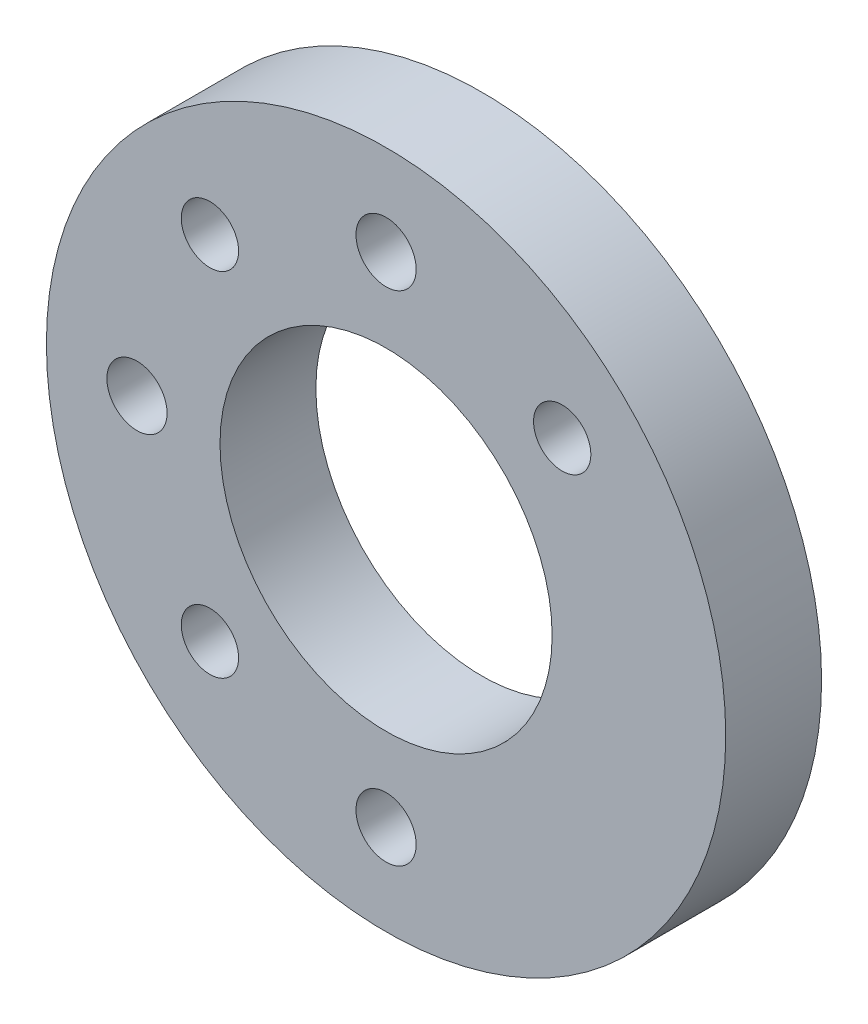
ISO-10303-21;
HEADER;
FILE_DESCRIPTION(('STEP AP214'),'2;1');
FILE_NAME('part.step','',(''),(''),'','','');
FILE_SCHEMA(('AUTOMOTIVE_DESIGN { 1 0 10303 214 1 1 1 1 }'));
ENDSEC;
DATA;
#1=APPLICATION_CONTEXT('core data for automotive mechanical design processes');
#2=APPLICATION_PROTOCOL_DEFINITION('international standard','automotive_design',2000,#1);
#3=PRODUCT_CONTEXT('',#1,'mechanical');
#4=PRODUCT('Part','Part','',(#3));
#5=PRODUCT_RELATED_PRODUCT_CATEGORY('part','',(#4));
#6=PRODUCT_DEFINITION_FORMATION('','',#4);
#7=PRODUCT_DEFINITION_CONTEXT('part definition',#1,'design');
#8=PRODUCT_DEFINITION('design','',#6,#7);
#9=PRODUCT_DEFINITION_SHAPE('','',#8);
#10=(LENGTH_UNIT() NAMED_UNIT(*) SI_UNIT(.MILLI.,.METRE.));
#11=(NAMED_UNIT(*) PLANE_ANGLE_UNIT() SI_UNIT($,.RADIAN.));
#12=(NAMED_UNIT(*) SI_UNIT($,.STERADIAN.) SOLID_ANGLE_UNIT());
#13=UNCERTAINTY_MEASURE_WITH_UNIT(LENGTH_MEASURE(1.E-05),#10,'distance_accuracy_value','');
#14=(GEOMETRIC_REPRESENTATION_CONTEXT(3) GLOBAL_UNCERTAINTY_ASSIGNED_CONTEXT((#13)) GLOBAL_UNIT_ASSIGNED_CONTEXT((#10,
#11,#12)) REPRESENTATION_CONTEXT('',''));
#15=CARTESIAN_POINT('',(0.,0.,0.));
#16=DIRECTION('',(0.,0.,1.));
#17=DIRECTION('',(1.,0.,0.));
#18=AXIS2_PLACEMENT_3D('',#15,#16,#17);
#19=CARTESIAN_POINT('',(0.,0.,6.35));
#20=DIRECTION('',(0.,0.,1.));
#21=DIRECTION('',(1.,0.,0.));
#22=AXIS2_PLACEMENT_3D('',#19,#20,#21);
#23=PLANE('',#22);
#24=CARTESIAN_POINT('',(-16.5,0.,6.35));
#25=DIRECTION('',(0.,0.,1.));
#26=DIRECTION('',(1.,0.,0.));
#27=AXIS2_PLACEMENT_3D('',#24,#25,#26);
#28=CIRCLE('',#27,1.9939);
#29=CARTESIAN_POINT('',(-14.5061,0.,6.35));
#30=VERTEX_POINT('',#29);
#31=EDGE_CURVE('E87',#30,#30,#28,.T.);
#32=ORIENTED_EDGE('',*,*,#31,.F.);
#33=EDGE_LOOP('',(#32));
#34=FACE_BOUND('',#33,.T.);
#35=CARTESIAN_POINT('',(0.,-16.5,6.35));
#36=DIRECTION('',(0.,0.,1.));
#37=DIRECTION('',(1.,0.,0.));
#38=AXIS2_PLACEMENT_3D('',#35,#36,#37);
#39=CIRCLE('',#38,1.9939);
#40=CARTESIAN_POINT('',(1.9939,-16.5,6.35));
#41=VERTEX_POINT('',#40);
#42=EDGE_CURVE('E78',#41,#41,#39,.T.);
#43=ORIENTED_EDGE('',*,*,#42,.F.);
#44=EDGE_LOOP('',(#43));
#45=FACE_BOUND('',#44,.T.);
#46=CARTESIAN_POINT('',(0.,16.5,6.35));
#47=DIRECTION('',(0.,0.,1.));
#48=DIRECTION('',(1.,0.,0.));
#49=AXIS2_PLACEMENT_3D('',#46,#47,#48);
#50=CIRCLE('',#49,1.9939);
#51=CARTESIAN_POINT('',(1.9939,16.5,6.35));
#52=VERTEX_POINT('',#51);
#53=EDGE_CURVE('E67',#52,#52,#50,.T.);
#54=ORIENTED_EDGE('',*,*,#53,.F.);
#55=EDGE_LOOP('',(#54));
#56=FACE_BOUND('',#55,.T.);
#57=CARTESIAN_POINT('',(0.,0.,6.35));
#58=DIRECTION('',(0.,0.,1.));
#59=DIRECTION('',(1.,0.,0.));
#60=AXIS2_PLACEMENT_3D('',#57,#58,#59);
#61=CIRCLE('',#60,22.5);
#62=CARTESIAN_POINT('',(22.5,0.,6.35));
#63=VERTEX_POINT('',#62);
#64=EDGE_CURVE('E57',#63,#63,#61,.T.);
#65=ORIENTED_EDGE('',*,*,#64,.T.);
#66=EDGE_LOOP('',(#65));
#67=FACE_BOUND('',#66,.T.);
#68=CARTESIAN_POINT('',(0.,0.,6.35));
#69=DIRECTION('',(0.,0.,1.));
#70=DIRECTION('',(1.,0.,0.));
#71=AXIS2_PLACEMENT_3D('',#68,#69,#70);
#72=CIRCLE('',#71,11.);
#73=CARTESIAN_POINT('',(11.,0.,6.35));
#74=VERTEX_POINT('',#73);
#75=EDGE_CURVE('E61',#74,#74,#72,.T.);
#76=ORIENTED_EDGE('',*,*,#75,.F.);
#77=EDGE_LOOP('',(#76));
#78=FACE_BOUND('',#77,.T.);
#79=CARTESIAN_POINT('',(11.6672618895781,11.667261889578,6.35));
#80=DIRECTION('',(0.,0.,1.));
#81=DIRECTION('',(1.,0.,0.));
#82=AXIS2_PLACEMENT_3D('',#79,#80,#81);
#83=CIRCLE('',#82,1.89865);
#84=CARTESIAN_POINT('',(13.5659118895781,11.667261889578,6.35));
#85=VERTEX_POINT('',#84);
#86=EDGE_CURVE('E73',#85,#85,#83,.T.);
#87=ORIENTED_EDGE('',*,*,#86,.F.);
#88=EDGE_LOOP('',(#87));
#89=FACE_BOUND('',#88,.T.);
#90=CARTESIAN_POINT('',(-11.667261889578,-11.667261889578,6.35));
#91=DIRECTION('',(0.,0.,1.));
#92=DIRECTION('',(1.,0.,0.));
#93=AXIS2_PLACEMENT_3D('',#90,#91,#92);
#94=CIRCLE('',#93,1.89865);
#95=CARTESIAN_POINT('',(-9.76861188957805,-11.667261889578,6.35));
#96=VERTEX_POINT('',#95);
#97=EDGE_CURVE('E82',#96,#96,#94,.T.);
#98=ORIENTED_EDGE('',*,*,#97,.F.);
#99=EDGE_LOOP('',(#98));
#100=FACE_BOUND('',#99,.T.);
#101=CARTESIAN_POINT('',(-11.667261889578,11.6672618895781,6.35));
#102=DIRECTION('',(0.,0.,1.));
#103=DIRECTION('',(1.,0.,0.));
#104=AXIS2_PLACEMENT_3D('',#101,#102,#103);
#105=CIRCLE('',#104,1.89865);
#106=CARTESIAN_POINT('',(-9.76861188957802,11.6672618895781,6.35));
#107=VERTEX_POINT('',#106);
#108=EDGE_CURVE('E91',#107,#107,#105,.T.);
#109=ORIENTED_EDGE('',*,*,#108,.F.);
#110=EDGE_LOOP('',(#109));
#111=FACE_BOUND('',#110,.T.);
#112=ADVANCED_FACE('F31',(#34,#45,#56,#67,#78,#89,#100,#111),#23,.T.);
#113=CARTESIAN_POINT('',(0.,0.,0.));
#114=DIRECTION('',(0.,0.,1.));
#115=DIRECTION('',(1.,0.,0.));
#116=AXIS2_PLACEMENT_3D('',#113,#114,#115);
#117=PLANE('',#116);
#118=CARTESIAN_POINT('',(-11.667261889578,-11.667261889578,0.));
#119=DIRECTION('',(0.,0.,1.));
#120=DIRECTION('',(1.,0.,0.));
#121=AXIS2_PLACEMENT_3D('',#118,#119,#120);
#122=CIRCLE('',#121,3.89890000002971);
#123=CARTESIAN_POINT('',(-7.76836188954834,-11.667261889578,0.));
#124=VERTEX_POINT('',#123);
#125=EDGE_CURVE('E46',#124,#124,#122,.T.);
#126=ORIENTED_EDGE('',*,*,#125,.T.);
#127=EDGE_LOOP('',(#126));
#128=FACE_BOUND('',#127,.T.);
#129=CARTESIAN_POINT('',(-11.667261889578,11.6672618895781,0.));
#130=DIRECTION('',(0.,0.,1.));
#131=DIRECTION('',(1.,0.,0.));
#132=AXIS2_PLACEMENT_3D('',#129,#130,#131);
#133=CIRCLE('',#132,3.89890000002971);
#134=CARTESIAN_POINT('',(-7.76836188954831,11.6672618895781,0.));
#135=VERTEX_POINT('',#134);
#136=EDGE_CURVE('E51',#135,#135,#133,.T.);
#137=ORIENTED_EDGE('',*,*,#136,.T.);
#138=EDGE_LOOP('',(#137));
#139=FACE_BOUND('',#138,.T.);
#140=CARTESIAN_POINT('',(11.6672618895781,11.667261889578,0.));
#141=DIRECTION('',(0.,0.,1.));
#142=DIRECTION('',(1.,0.,0.));
#143=AXIS2_PLACEMENT_3D('',#140,#141,#142);
#144=CIRCLE('',#143,3.89890000002971);
#145=CARTESIAN_POINT('',(15.5661618896078,11.667261889578,0.));
#146=VERTEX_POINT('',#145);
#147=EDGE_CURVE('E54',#146,#146,#144,.T.);
#148=ORIENTED_EDGE('',*,*,#147,.T.);
#149=EDGE_LOOP('',(#148));
#150=FACE_BOUND('',#149,.T.);
#151=CARTESIAN_POINT('',(0.,0.,0.));
#152=DIRECTION('',(0.,0.,1.));
#153=DIRECTION('',(1.,0.,0.));
#154=AXIS2_PLACEMENT_3D('',#151,#152,#153);
#155=CIRCLE('',#154,22.5);
#156=CARTESIAN_POINT('',(22.5,0.,0.));
#157=VERTEX_POINT('',#156);
#158=EDGE_CURVE('E58',#157,#157,#155,.T.);
#159=ORIENTED_EDGE('',*,*,#158,.F.);
#160=EDGE_LOOP('',(#159));
#161=FACE_BOUND('',#160,.T.);
#162=CARTESIAN_POINT('',(0.,0.,0.));
#163=DIRECTION('',(0.,0.,1.));
#164=DIRECTION('',(1.,0.,0.));
#165=AXIS2_PLACEMENT_3D('',#162,#163,#164);
#166=CIRCLE('',#165,11.);
#167=CARTESIAN_POINT('',(11.,0.,0.));
#168=VERTEX_POINT('',#167);
#169=EDGE_CURVE('E64',#168,#168,#166,.T.);
#170=ORIENTED_EDGE('',*,*,#169,.T.);
#171=EDGE_LOOP('',(#170));
#172=FACE_BOUND('',#171,.T.);
#173=CARTESIAN_POINT('',(0.,16.5,0.));
#174=DIRECTION('',(0.,0.,1.));
#175=DIRECTION('',(1.,0.,0.));
#176=AXIS2_PLACEMENT_3D('',#173,#174,#175);
#177=CIRCLE('',#176,1.9939);
#178=CARTESIAN_POINT('',(1.9939,16.5,0.));
#179=VERTEX_POINT('',#178);
#180=EDGE_CURVE('E70',#179,#179,#177,.T.);
#181=ORIENTED_EDGE('',*,*,#180,.T.);
#182=EDGE_LOOP('',(#181));
#183=FACE_BOUND('',#182,.T.);
#184=CARTESIAN_POINT('',(0.,-16.5,0.));
#185=DIRECTION('',(0.,0.,1.));
#186=DIRECTION('',(1.,0.,0.));
#187=AXIS2_PLACEMENT_3D('',#184,#185,#186);
#188=CIRCLE('',#187,1.9939);
#189=CARTESIAN_POINT('',(1.9939,-16.5,0.));
#190=VERTEX_POINT('',#189);
#191=EDGE_CURVE('E79',#190,#190,#188,.T.);
#192=ORIENTED_EDGE('',*,*,#191,.T.);
#193=EDGE_LOOP('',(#192));
#194=FACE_BOUND('',#193,.T.);
#195=CARTESIAN_POINT('',(-16.5,0.,0.));
#196=DIRECTION('',(0.,0.,1.));
#197=DIRECTION('',(1.,0.,0.));
#198=AXIS2_PLACEMENT_3D('',#195,#196,#197);
#199=CIRCLE('',#198,1.9939);
#200=CARTESIAN_POINT('',(-14.5061,0.,0.));
#201=VERTEX_POINT('',#200);
#202=EDGE_CURVE('E88',#201,#201,#199,.T.);
#203=ORIENTED_EDGE('',*,*,#202,.T.);
#204=EDGE_LOOP('',(#203));
#205=FACE_BOUND('',#204,.T.);
#206=ADVANCED_FACE('F100',(#128,#139,#150,#161,#172,#183,#194,#205),#117,.F.);
#207=CARTESIAN_POINT('',(0.,0.,6.35));
#208=DIRECTION('',(0.,0.,-1.));
#209=DIRECTION('',(-1.,0.,0.));
#210=AXIS2_PLACEMENT_3D('',#207,#208,#209);
#211=CYLINDRICAL_SURFACE('',#210,22.5);
#212=ORIENTED_EDGE('',*,*,#64,.F.);
#213=EDGE_LOOP('',(#212));
#214=FACE_BOUND('',#213,.T.);
#215=ORIENTED_EDGE('',*,*,#158,.T.);
#216=EDGE_LOOP('',(#215));
#217=FACE_BOUND('',#216,.T.);
#218=ADVANCED_FACE('F106',(#214,#217),#211,.T.);
#219=CARTESIAN_POINT('',(0.,0.,6.35));
#220=DIRECTION('',(0.,0.,-1.));
#221=DIRECTION('',(-1.,0.,0.));
#222=AXIS2_PLACEMENT_3D('',#219,#220,#221);
#223=CYLINDRICAL_SURFACE('',#222,11.);
#224=ORIENTED_EDGE('',*,*,#75,.T.);
#225=EDGE_LOOP('',(#224));
#226=FACE_BOUND('',#225,.T.);
#227=ORIENTED_EDGE('',*,*,#169,.F.);
#228=EDGE_LOOP('',(#227));
#229=FACE_BOUND('',#228,.T.);
#230=ADVANCED_FACE('F112',(#226,#229),#223,.F.);
#231=CARTESIAN_POINT('',(0.,16.5,6.35));
#232=DIRECTION('',(0.,0.,-1.));
#233=DIRECTION('',(-1.,0.,0.));
#234=AXIS2_PLACEMENT_3D('',#231,#232,#233);
#235=CYLINDRICAL_SURFACE('',#234,1.9939);
#236=ORIENTED_EDGE('',*,*,#53,.T.);
#237=EDGE_LOOP('',(#236));
#238=FACE_BOUND('',#237,.T.);
#239=ORIENTED_EDGE('',*,*,#180,.F.);
#240=EDGE_LOOP('',(#239));
#241=FACE_BOUND('',#240,.T.);
#242=ADVANCED_FACE('F163',(#238,#241),#235,.F.);
#243=CARTESIAN_POINT('',(11.6672618895781,11.667261889578,6.35));
#244=DIRECTION('',(0.,0.,-1.));
#245=DIRECTION('',(-1.,0.,0.));
#246=AXIS2_PLACEMENT_3D('',#243,#244,#245);
#247=CYLINDRICAL_SURFACE('',#246,1.89865);
#248=CARTESIAN_POINT('',(11.6672618895781,11.667261889578,2.30102440657801));
#249=DIRECTION('',(0.,0.,1.));
#250=DIRECTION('',(1.,0.,0.));
#251=AXIS2_PLACEMENT_3D('',#248,#249,#250);
#252=CIRCLE('',#251,1.89865);
#253=CARTESIAN_POINT('',(13.5659118895781,11.667261889578,2.30102440657801));
#254=VERTEX_POINT('',#253);
#255=EDGE_CURVE('E10',#254,#254,#252,.F.);
#256=ORIENTED_EDGE('',*,*,#255,.T.);
#257=EDGE_LOOP('',(#256));
#258=FACE_BOUND('',#257,.T.);
#259=ORIENTED_EDGE('',*,*,#86,.T.);
#260=EDGE_LOOP('',(#259));
#261=FACE_BOUND('',#260,.T.);
#262=ADVANCED_FACE('F160',(#258,#261),#247,.F.);
#263=CARTESIAN_POINT('',(0.,-16.5,6.35));
#264=DIRECTION('',(0.,0.,-1.));
#265=DIRECTION('',(-1.,0.,0.));
#266=AXIS2_PLACEMENT_3D('',#263,#264,#265);
#267=CYLINDRICAL_SURFACE('',#266,1.9939);
#268=ORIENTED_EDGE('',*,*,#42,.T.);
#269=EDGE_LOOP('',(#268));
#270=FACE_BOUND('',#269,.T.);
#271=ORIENTED_EDGE('',*,*,#191,.F.);
#272=EDGE_LOOP('',(#271));
#273=FACE_BOUND('',#272,.T.);
#274=ADVANCED_FACE('F154',(#270,#273),#267,.F.);
#275=CARTESIAN_POINT('',(-11.667261889578,-11.667261889578,6.35));
#276=DIRECTION('',(0.,0.,-1.));
#277=DIRECTION('',(-1.,0.,0.));
#278=AXIS2_PLACEMENT_3D('',#275,#276,#277);
#279=CYLINDRICAL_SURFACE('',#278,1.89865);
#280=CARTESIAN_POINT('',(-11.667261889578,-11.667261889578,2.30102440657801));
#281=DIRECTION('',(0.,0.,1.));
#282=DIRECTION('',(1.,0.,0.));
#283=AXIS2_PLACEMENT_3D('',#280,#281,#282);
#284=CIRCLE('',#283,1.89865);
#285=CARTESIAN_POINT('',(-9.76861188957805,-11.667261889578,2.30102440657801));
#286=VERTEX_POINT('',#285);
#287=EDGE_CURVE('E42',#286,#286,#284,.F.);
#288=ORIENTED_EDGE('',*,*,#287,.T.);
#289=EDGE_LOOP('',(#288));
#290=FACE_BOUND('',#289,.T.);
#291=ORIENTED_EDGE('',*,*,#97,.T.);
#292=EDGE_LOOP('',(#291));
#293=FACE_BOUND('',#292,.T.);
#294=ADVANCED_FACE('F146',(#290,#293),#279,.F.);
#295=CARTESIAN_POINT('',(-16.5,0.,6.35));
#296=DIRECTION('',(0.,0.,-1.));
#297=DIRECTION('',(-1.,0.,0.));
#298=AXIS2_PLACEMENT_3D('',#295,#296,#297);
#299=CYLINDRICAL_SURFACE('',#298,1.9939);
#300=ORIENTED_EDGE('',*,*,#31,.T.);
#301=EDGE_LOOP('',(#300));
#302=FACE_BOUND('',#301,.T.);
#303=ORIENTED_EDGE('',*,*,#202,.F.);
#304=EDGE_LOOP('',(#303));
#305=FACE_BOUND('',#304,.T.);
#306=ADVANCED_FACE('F144',(#302,#305),#299,.F.);
#307=CARTESIAN_POINT('',(-11.667261889578,11.6672618895781,6.35));
#308=DIRECTION('',(0.,0.,-1.));
#309=DIRECTION('',(-1.,0.,0.));
#310=AXIS2_PLACEMENT_3D('',#307,#308,#309);
#311=CYLINDRICAL_SURFACE('',#310,1.89865);
#312=CARTESIAN_POINT('',(-11.667261889578,11.6672618895781,2.30102440657801));
#313=DIRECTION('',(0.,0.,1.));
#314=DIRECTION('',(1.,0.,0.));
#315=AXIS2_PLACEMENT_3D('',#312,#313,#314);
#316=CIRCLE('',#315,1.89865);
#317=CARTESIAN_POINT('',(-9.76861188957802,11.6672618895781,2.30102440657801));
#318=VERTEX_POINT('',#317);
#319=EDGE_CURVE('E38',#318,#318,#316,.F.);
#320=ORIENTED_EDGE('',*,*,#319,.T.);
#321=EDGE_LOOP('',(#320));
#322=FACE_BOUND('',#321,.T.);
#323=ORIENTED_EDGE('',*,*,#108,.T.);
#324=EDGE_LOOP('',(#323));
#325=FACE_BOUND('',#324,.T.);
#326=ADVANCED_FACE('F97',(#322,#325),#311,.F.);
#327=CARTESIAN_POINT('',(-11.667261889578,-11.667261889578,0.));
#328=DIRECTION('',(0.,0.,-1.));
#329=DIRECTION('',(-1.,0.,0.));
#330=AXIS2_PLACEMENT_3D('',#327,#328,#329);
#331=CONICAL_SURFACE('',#330,3.89890000002971,0.715584993317673);
#332=ORIENTED_EDGE('',*,*,#287,.F.);
#333=EDGE_LOOP('',(#332));
#334=FACE_BOUND('',#333,.T.);
#335=ORIENTED_EDGE('',*,*,#125,.F.);
#336=EDGE_LOOP('',(#335));
#337=FACE_BOUND('',#336,.T.);
#338=ADVANCED_FACE('F118',(#334,#337),#331,.F.);
#339=CARTESIAN_POINT('',(-11.667261889578,11.6672618895781,0.));
#340=DIRECTION('',(0.,0.,-1.));
#341=DIRECTION('',(-1.,0.,0.));
#342=AXIS2_PLACEMENT_3D('',#339,#340,#341);
#343=CONICAL_SURFACE('',#342,3.89890000002971,0.715584993317673);
#344=ORIENTED_EDGE('',*,*,#319,.F.);
#345=EDGE_LOOP('',(#344));
#346=FACE_BOUND('',#345,.T.);
#347=ORIENTED_EDGE('',*,*,#136,.F.);
#348=EDGE_LOOP('',(#347));
#349=FACE_BOUND('',#348,.T.);
#350=ADVANCED_FACE('F120',(#346,#349),#343,.F.);
#351=CARTESIAN_POINT('',(11.6672618895781,11.667261889578,0.));
#352=DIRECTION('',(0.,0.,-1.));
#353=DIRECTION('',(-1.,0.,0.));
#354=AXIS2_PLACEMENT_3D('',#351,#352,#353);
#355=CONICAL_SURFACE('',#354,3.89890000002971,0.715584993317673);
#356=ORIENTED_EDGE('',*,*,#255,.F.);
#357=EDGE_LOOP('',(#356));
#358=FACE_BOUND('',#357,.T.);
#359=ORIENTED_EDGE('',*,*,#147,.F.);
#360=EDGE_LOOP('',(#359));
#361=FACE_BOUND('',#360,.T.);
#362=ADVANCED_FACE('F33',(#358,#361),#355,.F.);
#363=CLOSED_SHELL('',(#112,#206,#218,#230,#242,#262,#274,#294,#306,#326,#338,#350,#362));
#364=MANIFOLD_SOLID_BREP('B2',#363);
#365=ADVANCED_BREP_SHAPE_REPRESENTATION('',(#18,#364),#14);
#366=SHAPE_DEFINITION_REPRESENTATION(#9,#365);
ENDSEC;
END-ISO-10303-21;
